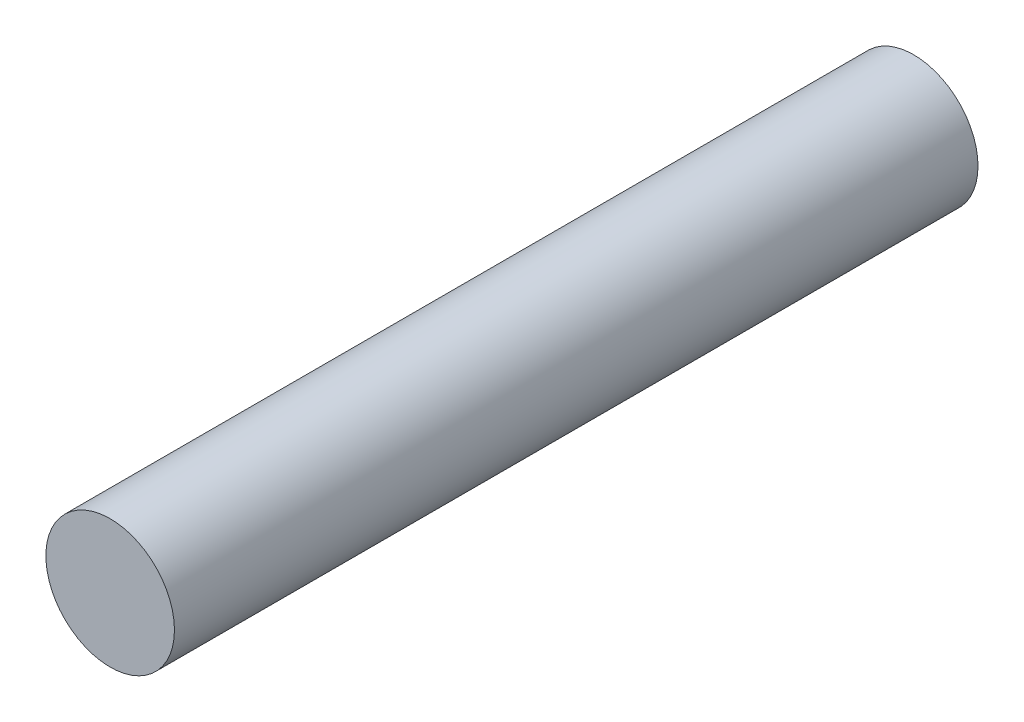
ISO-10303-21;
HEADER;
FILE_DESCRIPTION(('STEP AP214'),'2;1');
FILE_NAME('part.step','',(''),(''),'','','');
FILE_SCHEMA(('AUTOMOTIVE_DESIGN { 1 0 10303 214 1 1 1 1 }'));
ENDSEC;
DATA;
#1=APPLICATION_CONTEXT('core data for automotive mechanical design processes');
#2=APPLICATION_PROTOCOL_DEFINITION('international standard','automotive_design',2000,#1);
#3=PRODUCT_CONTEXT('',#1,'mechanical');
#4=PRODUCT('Part','Part','',(#3));
#5=PRODUCT_RELATED_PRODUCT_CATEGORY('part','',(#4));
#6=PRODUCT_DEFINITION_FORMATION('','',#4);
#7=PRODUCT_DEFINITION_CONTEXT('part definition',#1,'design');
#8=PRODUCT_DEFINITION('design','',#6,#7);
#9=PRODUCT_DEFINITION_SHAPE('','',#8);
#10=(LENGTH_UNIT() NAMED_UNIT(*) SI_UNIT(.MILLI.,.METRE.));
#11=(NAMED_UNIT(*) PLANE_ANGLE_UNIT() SI_UNIT($,.RADIAN.));
#12=(NAMED_UNIT(*) SI_UNIT($,.STERADIAN.) SOLID_ANGLE_UNIT());
#13=UNCERTAINTY_MEASURE_WITH_UNIT(LENGTH_MEASURE(1.E-05),#10,'distance_accuracy_value','');
#14=(GEOMETRIC_REPRESENTATION_CONTEXT(3) GLOBAL_UNCERTAINTY_ASSIGNED_CONTEXT((#13)) GLOBAL_UNIT_ASSIGNED_CONTEXT((#10,
#11,#12)) REPRESENTATION_CONTEXT('',''));
#15=CARTESIAN_POINT('',(0.,0.,0.));
#16=DIRECTION('',(0.,0.,1.));
#17=DIRECTION('',(1.,0.,0.));
#18=AXIS2_PLACEMENT_3D('',#15,#16,#17);
#19=CARTESIAN_POINT('',(-11.0870727486133,-4.85838019321258,100.));
#20=DIRECTION('',(0.,0.,-1.));
#21=DIRECTION('',(-1.,0.,0.));
#22=AXIS2_PLACEMENT_3D('',#19,#20,#21);
#23=CYLINDRICAL_SURFACE('',#22,8.);
#24=CARTESIAN_POINT('',(-11.0870727486133,-4.85838019321258,100.));
#25=DIRECTION('',(0.,0.,1.));
#26=DIRECTION('',(1.,0.,0.));
#27=AXIS2_PLACEMENT_3D('',#24,#25,#26);
#28=CIRCLE('',#27,8.);
#29=CARTESIAN_POINT('',(-3.08707274861332,-4.85838019321258,100.));
#30=VERTEX_POINT('',#29);
#31=EDGE_CURVE('E10',#30,#30,#28,.T.);
#32=ORIENTED_EDGE('',*,*,#31,.F.);
#33=EDGE_LOOP('',(#32));
#34=FACE_BOUND('',#33,.T.);
#35=CARTESIAN_POINT('',(-11.0870727486133,-4.85838019321258,0.));
#36=DIRECTION('',(0.,0.,1.));
#37=DIRECTION('',(1.,0.,0.));
#38=AXIS2_PLACEMENT_3D('',#35,#36,#37);
#39=CIRCLE('',#38,8.);
#40=CARTESIAN_POINT('',(-3.08707274861332,-4.85838019321258,0.));
#41=VERTEX_POINT('',#40);
#42=EDGE_CURVE('E36',#41,#41,#39,.T.);
#43=ORIENTED_EDGE('',*,*,#42,.T.);
#44=EDGE_LOOP('',(#43));
#45=FACE_BOUND('',#44,.T.);
#46=ADVANCED_FACE('F33',(#34,#45),#23,.T.);
#47=CARTESIAN_POINT('',(-11.0870727486133,-4.85838019321258,100.));
#48=DIRECTION('',(0.,0.,1.));
#49=DIRECTION('',(1.,0.,0.));
#50=AXIS2_PLACEMENT_3D('',#47,#48,#49);
#51=PLANE('',#50);
#52=ORIENTED_EDGE('',*,*,#31,.T.);
#53=EDGE_LOOP('',(#52));
#54=FACE_BOUND('',#53,.T.);
#55=ADVANCED_FACE('F48',(#54),#51,.T.);
#56=CARTESIAN_POINT('',(-11.0870727486133,-4.85838019321258,0.));
#57=DIRECTION('',(0.,0.,1.));
#58=DIRECTION('',(1.,0.,0.));
#59=AXIS2_PLACEMENT_3D('',#56,#57,#58);
#60=PLANE('',#59);
#61=ORIENTED_EDGE('',*,*,#42,.F.);
#62=EDGE_LOOP('',(#61));
#63=FACE_BOUND('',#62,.T.);
#64=ADVANCED_FACE('F46',(#63),#60,.F.);
#65=CLOSED_SHELL('',(#46,#55,#64));
#66=MANIFOLD_SOLID_BREP('B2',#65);
#67=ADVANCED_BREP_SHAPE_REPRESENTATION('',(#18,#66),#14);
#68=SHAPE_DEFINITION_REPRESENTATION(#9,#67);
ENDSEC;
END-ISO-10303-21;
